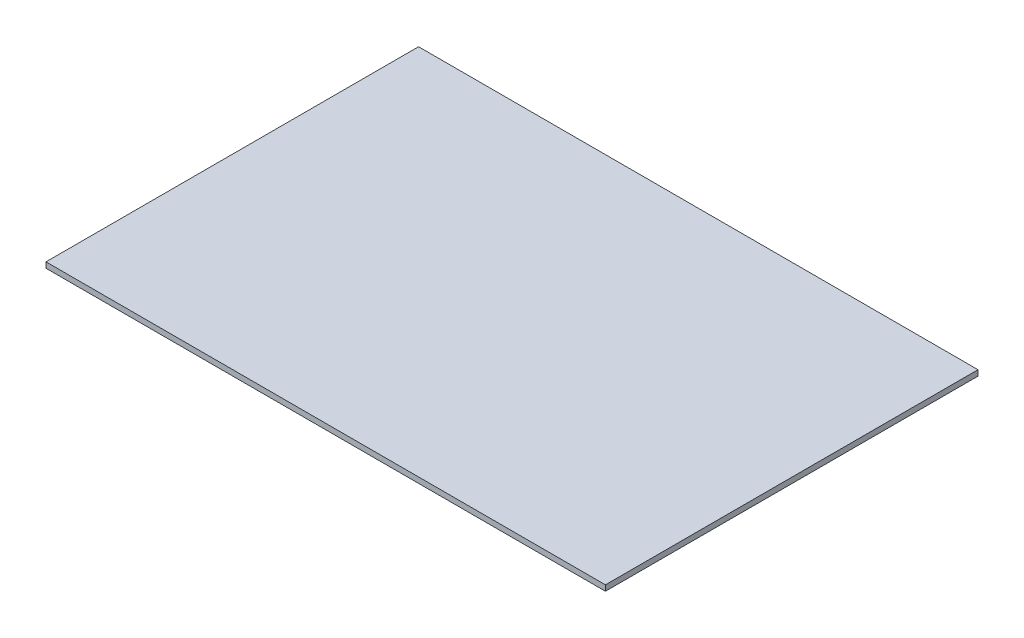
ISO-10303-21;
HEADER;
FILE_DESCRIPTION(('STEP AP214'),'2;1');
FILE_NAME('part.step','',(''),(''),'','','');
FILE_SCHEMA(('AUTOMOTIVE_DESIGN { 1 0 10303 214 1 1 1 1 }'));
ENDSEC;
DATA;
#1=APPLICATION_CONTEXT('core data for automotive mechanical design processes');
#2=APPLICATION_PROTOCOL_DEFINITION('international standard','automotive_design',2000,#1);
#3=PRODUCT_CONTEXT('',#1,'mechanical');
#4=PRODUCT('Part','Part','',(#3));
#5=PRODUCT_RELATED_PRODUCT_CATEGORY('part','',(#4));
#6=PRODUCT_DEFINITION_FORMATION('','',#4);
#7=PRODUCT_DEFINITION_CONTEXT('part definition',#1,'design');
#8=PRODUCT_DEFINITION('design','',#6,#7);
#9=PRODUCT_DEFINITION_SHAPE('','',#8);
#10=(LENGTH_UNIT() NAMED_UNIT(*) SI_UNIT(.MILLI.,.METRE.));
#11=(NAMED_UNIT(*) PLANE_ANGLE_UNIT() SI_UNIT($,.RADIAN.));
#12=(NAMED_UNIT(*) SI_UNIT($,.STERADIAN.) SOLID_ANGLE_UNIT());
#13=UNCERTAINTY_MEASURE_WITH_UNIT(LENGTH_MEASURE(1.E-05),#10,'distance_accuracy_value','');
#14=(GEOMETRIC_REPRESENTATION_CONTEXT(3) GLOBAL_UNCERTAINTY_ASSIGNED_CONTEXT((#13)) GLOBAL_UNIT_ASSIGNED_CONTEXT((#10,
#11,#12)) REPRESENTATION_CONTEXT('',''));
#15=CARTESIAN_POINT('',(0.,0.,0.));
#16=DIRECTION('',(0.,0.,1.));
#17=DIRECTION('',(1.,0.,0.));
#18=AXIS2_PLACEMENT_3D('',#15,#16,#17);
#19=CARTESIAN_POINT('',(0.,10.,0.));
#20=DIRECTION('',(1.,0.,0.));
#21=DIRECTION('',(0.,0.,-1.));
#22=AXIS2_PLACEMENT_3D('',#19,#20,#21);
#23=PLANE('',#22);
#24=DIRECTION('',(0.,0.,1.));
#25=VECTOR('',#24,1.);
#26=CARTESIAN_POINT('',(0.,0.,0.));
#27=LINE('',#26,#25);
#28=CARTESIAN_POINT('',(0.,0.,-666.));
#29=VERTEX_POINT('',#28);
#30=CARTESIAN_POINT('',(0.,0.,0.));
#31=VERTEX_POINT('',#30);
#32=EDGE_CURVE('E94',#29,#31,#27,.T.);
#33=ORIENTED_EDGE('',*,*,#32,.T.);
#34=DIRECTION('',(0.,-1.,0.));
#35=VECTOR('',#34,1.);
#36=CARTESIAN_POINT('',(0.,10.,0.));
#37=LINE('',#36,#35);
#38=CARTESIAN_POINT('',(0.,10.,0.));
#39=VERTEX_POINT('',#38);
#40=EDGE_CURVE('E11',#39,#31,#37,.T.);
#41=ORIENTED_EDGE('',*,*,#40,.F.);
#42=DIRECTION('',(0.,0.,1.));
#43=VECTOR('',#42,1.);
#44=CARTESIAN_POINT('',(0.,10.,0.));
#45=LINE('',#44,#43);
#46=CARTESIAN_POINT('',(0.,10.,-666.));
#47=VERTEX_POINT('',#46);
#48=EDGE_CURVE('E82',#47,#39,#45,.T.);
#49=ORIENTED_EDGE('',*,*,#48,.F.);
#50=DIRECTION('',(0.,-1.,0.));
#51=VECTOR('',#50,1.);
#52=CARTESIAN_POINT('',(0.,10.,-666.));
#53=LINE('',#52,#51);
#54=EDGE_CURVE('E90',#47,#29,#53,.T.);
#55=ORIENTED_EDGE('',*,*,#54,.T.);
#56=EDGE_LOOP('',(#33,#41,#49,#55));
#57=FACE_BOUND('',#56,.T.);
#58=ADVANCED_FACE('F31',(#57),#23,.F.);
#59=CARTESIAN_POINT('',(0.,10.,0.));
#60=DIRECTION('',(0.,0.,-1.));
#61=DIRECTION('',(-1.,0.,0.));
#62=AXIS2_PLACEMENT_3D('',#59,#60,#61);
#63=PLANE('',#62);
#64=DIRECTION('',(1.,0.,0.));
#65=VECTOR('',#64,1.);
#66=CARTESIAN_POINT('',(0.,0.,0.));
#67=LINE('',#66,#65);
#68=CARTESIAN_POINT('',(1000.,0.,0.));
#69=VERTEX_POINT('',#68);
#70=EDGE_CURVE('E86',#31,#69,#67,.T.);
#71=ORIENTED_EDGE('',*,*,#70,.T.);
#72=DIRECTION('',(0.,-1.,0.));
#73=VECTOR('',#72,1.);
#74=CARTESIAN_POINT('',(1000.,10.,0.));
#75=LINE('',#74,#73);
#76=CARTESIAN_POINT('',(1000.,10.,0.));
#77=VERTEX_POINT('',#76);
#78=EDGE_CURVE('E39',#77,#69,#75,.T.);
#79=ORIENTED_EDGE('',*,*,#78,.F.);
#80=DIRECTION('',(1.,0.,0.));
#81=VECTOR('',#80,1.);
#82=CARTESIAN_POINT('',(0.,10.,0.));
#83=LINE('',#82,#81);
#84=EDGE_CURVE('E77',#39,#77,#83,.T.);
#85=ORIENTED_EDGE('',*,*,#84,.F.);
#86=ORIENTED_EDGE('',*,*,#40,.T.);
#87=EDGE_LOOP('',(#71,#79,#85,#86));
#88=FACE_BOUND('',#87,.T.);
#89=ADVANCED_FACE('F85',(#88),#63,.F.);
#90=CARTESIAN_POINT('',(1000.,10.,0.));
#91=DIRECTION('',(-1.,0.,0.));
#92=DIRECTION('',(0.,0.,1.));
#93=AXIS2_PLACEMENT_3D('',#90,#91,#92);
#94=PLANE('',#93);
#95=DIRECTION('',(0.,0.,-1.));
#96=VECTOR('',#95,1.);
#97=CARTESIAN_POINT('',(1000.,0.,0.));
#98=LINE('',#97,#96);
#99=CARTESIAN_POINT('',(1000.,0.,-666.));
#100=VERTEX_POINT('',#99);
#101=EDGE_CURVE('E64',#69,#100,#98,.T.);
#102=ORIENTED_EDGE('',*,*,#101,.T.);
#103=DIRECTION('',(0.,-1.,0.));
#104=VECTOR('',#103,1.);
#105=CARTESIAN_POINT('',(1000.,10.,-666.));
#106=LINE('',#105,#104);
#107=CARTESIAN_POINT('',(1000.,10.,-666.));
#108=VERTEX_POINT('',#107);
#109=EDGE_CURVE('E87',#108,#100,#106,.T.);
#110=ORIENTED_EDGE('',*,*,#109,.F.);
#111=DIRECTION('',(0.,0.,-1.));
#112=VECTOR('',#111,1.);
#113=CARTESIAN_POINT('',(1000.,10.,0.));
#114=LINE('',#113,#112);
#115=EDGE_CURVE('E80',#77,#108,#114,.T.);
#116=ORIENTED_EDGE('',*,*,#115,.F.);
#117=ORIENTED_EDGE('',*,*,#78,.T.);
#118=EDGE_LOOP('',(#102,#110,#116,#117));
#119=FACE_BOUND('',#118,.T.);
#120=ADVANCED_FACE('F88',(#119),#94,.F.);
#121=CARTESIAN_POINT('',(0.,10.,-666.));
#122=DIRECTION('',(0.,0.,1.));
#123=DIRECTION('',(1.,0.,0.));
#124=AXIS2_PLACEMENT_3D('',#121,#122,#123);
#125=PLANE('',#124);
#126=DIRECTION('',(-1.,0.,0.));
#127=VECTOR('',#126,1.);
#128=CARTESIAN_POINT('',(0.,0.,-666.));
#129=LINE('',#128,#127);
#130=EDGE_CURVE('E70',#100,#29,#129,.T.);
#131=ORIENTED_EDGE('',*,*,#130,.T.);
#132=ORIENTED_EDGE('',*,*,#54,.F.);
#133=DIRECTION('',(-1.,0.,0.));
#134=VECTOR('',#133,1.);
#135=CARTESIAN_POINT('',(0.,10.,-666.));
#136=LINE('',#135,#134);
#137=EDGE_CURVE('E47',#108,#47,#136,.T.);
#138=ORIENTED_EDGE('',*,*,#137,.F.);
#139=ORIENTED_EDGE('',*,*,#109,.T.);
#140=EDGE_LOOP('',(#131,#132,#138,#139));
#141=FACE_BOUND('',#140,.T.);
#142=ADVANCED_FACE('F101',(#141),#125,.F.);
#143=CARTESIAN_POINT('',(0.,10.,-666.));
#144=DIRECTION('',(0.,-1.,0.));
#145=DIRECTION('',(0.,0.,-1.));
#146=AXIS2_PLACEMENT_3D('',#143,#144,#145);
#147=PLANE('',#146);
#148=ORIENTED_EDGE('',*,*,#48,.T.);
#149=ORIENTED_EDGE('',*,*,#84,.T.);
#150=ORIENTED_EDGE('',*,*,#115,.T.);
#151=ORIENTED_EDGE('',*,*,#137,.T.);
#152=EDGE_LOOP('',(#148,#149,#150,#151));
#153=FACE_BOUND('',#152,.T.);
#154=ADVANCED_FACE('F78',(#153),#147,.F.);
#155=CARTESIAN_POINT('',(0.,0.,-666.));
#156=DIRECTION('',(0.,-1.,0.));
#157=DIRECTION('',(0.,0.,-1.));
#158=AXIS2_PLACEMENT_3D('',#155,#156,#157);
#159=PLANE('',#158);
#160=ORIENTED_EDGE('',*,*,#32,.F.);
#161=ORIENTED_EDGE('',*,*,#130,.F.);
#162=ORIENTED_EDGE('',*,*,#101,.F.);
#163=ORIENTED_EDGE('',*,*,#70,.F.);
#164=EDGE_LOOP('',(#160,#161,#162,#163));
#165=FACE_BOUND('',#164,.T.);
#166=ADVANCED_FACE('F104',(#165),#159,.T.);
#167=CLOSED_SHELL('',(#58,#89,#120,#142,#154,#166));
#168=MANIFOLD_SOLID_BREP('B2',#167);
#169=ADVANCED_BREP_SHAPE_REPRESENTATION('',(#18,#168),#14);
#170=SHAPE_DEFINITION_REPRESENTATION(#9,#169);
ENDSEC;
END-ISO-10303-21;
